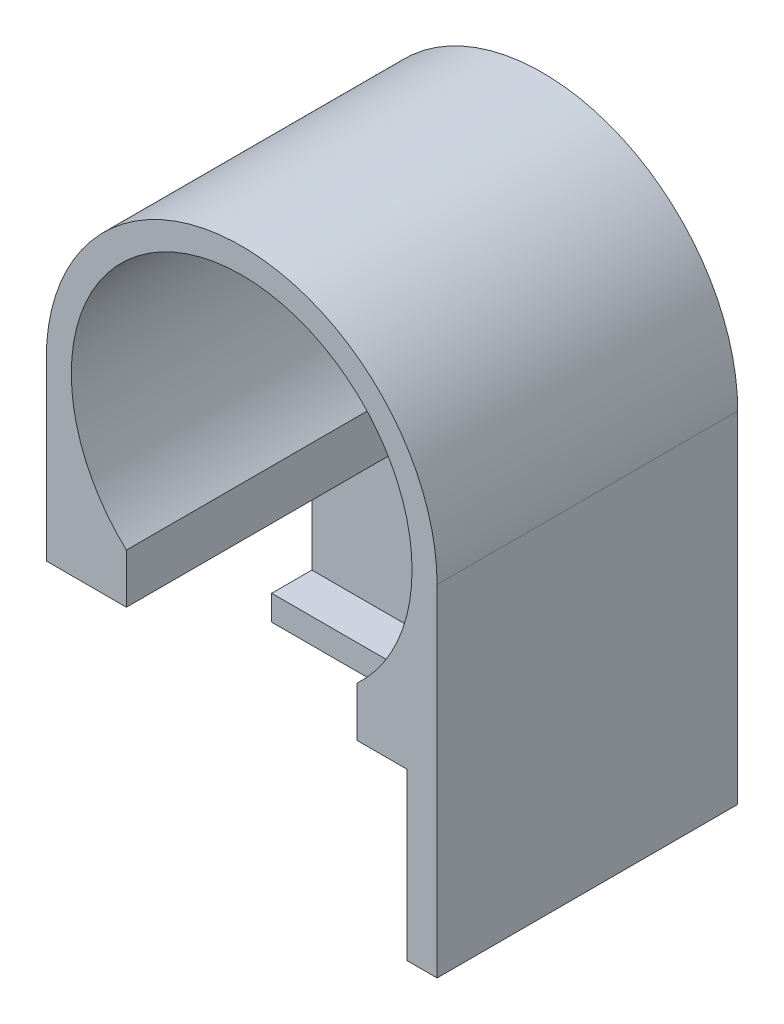
ISO-10303-21;
HEADER;
FILE_DESCRIPTION(('STEP AP214'),'2;1');
FILE_NAME('part.step','',(''),(''),'','','');
FILE_SCHEMA(('AUTOMOTIVE_DESIGN { 1 0 10303 214 1 1 1 1 }'));
ENDSEC;
DATA;
#1=APPLICATION_CONTEXT('core data for automotive mechanical design processes');
#2=APPLICATION_PROTOCOL_DEFINITION('international standard','automotive_design',2000,#1);
#3=PRODUCT_CONTEXT('',#1,'mechanical');
#4=PRODUCT('Part','Part','',(#3));
#5=PRODUCT_RELATED_PRODUCT_CATEGORY('part','',(#4));
#6=PRODUCT_DEFINITION_FORMATION('','',#4);
#7=PRODUCT_DEFINITION_CONTEXT('part definition',#1,'design');
#8=PRODUCT_DEFINITION('design','',#6,#7);
#9=PRODUCT_DEFINITION_SHAPE('','',#8);
#10=(LENGTH_UNIT() NAMED_UNIT(*) SI_UNIT(.MILLI.,.METRE.));
#11=(NAMED_UNIT(*) PLANE_ANGLE_UNIT() SI_UNIT($,.RADIAN.));
#12=(NAMED_UNIT(*) SI_UNIT($,.STERADIAN.) SOLID_ANGLE_UNIT());
#13=UNCERTAINTY_MEASURE_WITH_UNIT(LENGTH_MEASURE(1.E-05),#10,'distance_accuracy_value','');
#14=(GEOMETRIC_REPRESENTATION_CONTEXT(3) GLOBAL_UNCERTAINTY_ASSIGNED_CONTEXT((#13)) GLOBAL_UNIT_ASSIGNED_CONTEXT((#10,
#11,#12)) REPRESENTATION_CONTEXT('',''));
#15=CARTESIAN_POINT('',(0.,0.,0.));
#16=DIRECTION('',(0.,0.,1.));
#17=DIRECTION('',(1.,0.,0.));
#18=AXIS2_PLACEMENT_3D('',#15,#16,#17);
#19=CARTESIAN_POINT('',(0.,0.,76.2));
#20=DIRECTION('',(0.,0.,1.));
#21=DIRECTION('',(1.,0.,0.));
#22=AXIS2_PLACEMENT_3D('',#19,#20,#21);
#23=PLANE('',#22);
#24=DIRECTION('',(-1.,0.,0.));
#25=VECTOR('',#24,1.);
#26=CARTESIAN_POINT('',(41.91,-44.3563914856903,76.2));
#27=LINE('',#26,#25);
#28=CARTESIAN_POINT('',(-29.21,-44.3563914856903,76.2));
#29=VERTEX_POINT('',#28);
#30=CARTESIAN_POINT('',(-49.53,-44.3563914856903,76.2));
#31=VERTEX_POINT('',#30);
#32=EDGE_CURVE('E186',#29,#31,#27,.T.);
#33=ORIENTED_EDGE('',*,*,#32,.F.);
#34=DIRECTION('',(0.,1.,0.));
#35=VECTOR('',#34,1.);
#36=CARTESIAN_POINT('',(-29.21,-64.4223914856903,76.2));
#37=LINE('',#36,#35);
#38=CARTESIAN_POINT('',(-29.21,-31.8007594248943,76.2));
#39=VERTEX_POINT('',#38);
#40=EDGE_CURVE('E274',#29,#39,#37,.T.);
#41=ORIENTED_EDGE('',*,*,#40,.T.);
#42=CARTESIAN_POINT('',(0.,0.,76.2));
#43=DIRECTION('',(0.,0.,1.));
#44=DIRECTION('',(1.,0.,0.));
#45=AXIS2_PLACEMENT_3D('',#42,#43,#44);
#46=CIRCLE('',#45,43.18);
#47=CARTESIAN_POINT('',(29.21,-31.8007594248943,76.2));
#48=VERTEX_POINT('',#47);
#49=EDGE_CURVE('E223',#48,#39,#46,.T.);
#50=ORIENTED_EDGE('',*,*,#49,.F.);
#51=DIRECTION('',(0.,1.,0.));
#52=VECTOR('',#51,1.);
#53=CARTESIAN_POINT('',(29.21,-64.4223914856903,76.2));
#54=LINE('',#53,#52);
#55=CARTESIAN_POINT('',(29.21,-44.3563914856903,76.2));
#56=VERTEX_POINT('',#55);
#57=EDGE_CURVE('E132',#56,#48,#54,.T.);
#58=ORIENTED_EDGE('',*,*,#57,.F.);
#59=CARTESIAN_POINT('',(41.91,-44.3563914856903,76.2));
#60=VERTEX_POINT('',#59);
#61=EDGE_CURVE('E182',#60,#56,#27,.T.);
#62=ORIENTED_EDGE('',*,*,#61,.F.);
#63=DIRECTION('',(0.,1.,0.));
#64=VECTOR('',#63,1.);
#65=CARTESIAN_POINT('',(41.91,0.,76.2));
#66=LINE('',#65,#64);
#67=CARTESIAN_POINT('',(41.91,-86.36,76.2));
#68=VERTEX_POINT('',#67);
#69=EDGE_CURVE('E171',#68,#60,#66,.T.);
#70=ORIENTED_EDGE('',*,*,#69,.F.);
#71=DIRECTION('',(-1.,0.,0.));
#72=VECTOR('',#71,1.);
#73=CARTESIAN_POINT('',(0.,-86.36,76.2));
#74=LINE('',#73,#72);
#75=CARTESIAN_POINT('',(49.53,-86.36,76.2));
#76=VERTEX_POINT('',#75);
#77=EDGE_CURVE('E198',#76,#68,#74,.T.);
#78=ORIENTED_EDGE('',*,*,#77,.F.);
#79=DIRECTION('',(0.,-1.,0.));
#80=VECTOR('',#79,1.);
#81=CARTESIAN_POINT('',(49.53,0.,76.2));
#82=LINE('',#81,#80);
#83=CARTESIAN_POINT('',(49.53,0.,76.2));
#84=VERTEX_POINT('',#83);
#85=EDGE_CURVE('E202',#84,#76,#82,.T.);
#86=ORIENTED_EDGE('',*,*,#85,.F.);
#87=CARTESIAN_POINT('',(0.,0.,76.2));
#88=DIRECTION('',(0.,0.,1.));
#89=DIRECTION('',(1.,0.,0.));
#90=AXIS2_PLACEMENT_3D('',#87,#88,#89);
#91=CIRCLE('',#90,49.53);
#92=CARTESIAN_POINT('',(-49.53,0.,76.2));
#93=VERTEX_POINT('',#92);
#94=EDGE_CURVE('E11',#84,#93,#91,.T.);
#95=ORIENTED_EDGE('',*,*,#94,.T.);
#96=DIRECTION('',(0.,-1.,0.));
#97=VECTOR('',#96,1.);
#98=CARTESIAN_POINT('',(-49.53,0.,76.2));
#99=LINE('',#98,#97);
#100=EDGE_CURVE('E195',#93,#31,#99,.T.);
#101=ORIENTED_EDGE('',*,*,#100,.T.);
#102=EDGE_LOOP('',(#33,#41,#50,#58,#62,#70,#78,#86,#95,#101));
#103=FACE_BOUND('',#102,.T.);
#104=ADVANCED_FACE('F36',(#103),#23,.T.);
#105=CARTESIAN_POINT('',(0.,0.,76.2));
#106=DIRECTION('',(0.,0.,-1.));
#107=DIRECTION('',(-1.,0.,0.));
#108=AXIS2_PLACEMENT_3D('',#105,#106,#107);
#109=CYLINDRICAL_SURFACE('',#108,43.18);
#110=CARTESIAN_POINT('',(0.,0.,0.));
#111=DIRECTION('',(0.,0.,1.));
#112=DIRECTION('',(1.,0.,0.));
#113=AXIS2_PLACEMENT_3D('',#110,#111,#112);
#114=CIRCLE('',#113,43.18);
#115=CARTESIAN_POINT('',(43.18,0.,0.));
#116=VERTEX_POINT('',#115);
#117=EDGE_CURVE('E222',#116,#116,#114,.T.);
#118=ORIENTED_EDGE('',*,*,#117,.F.);
#119=EDGE_LOOP('',(#118));
#120=FACE_BOUND('',#119,.T.);
#121=ORIENTED_EDGE('',*,*,#49,.T.);
#122=DIRECTION('',(0.,0.,-1.));
#123=VECTOR('',#122,1.);
#124=CARTESIAN_POINT('',(-29.21,-31.8007594248942,76.2));
#125=LINE('',#124,#123);
#126=CARTESIAN_POINT('',(-29.21,-31.8007594248942,8.8798451922827));
#127=VERTEX_POINT('',#126);
#128=EDGE_CURVE('E152',#39,#127,#125,.T.);
#129=ORIENTED_EDGE('',*,*,#128,.T.);
#130=CARTESIAN_POINT('',(0.,0.,8.8798451922827));
#131=DIRECTION('',(0.,0.,1.));
#132=DIRECTION('',(1.,0.,0.));
#133=AXIS2_PLACEMENT_3D('',#130,#131,#132);
#134=CIRCLE('',#133,43.18);
#135=CARTESIAN_POINT('',(29.21,-31.8007594248943,8.87984519228268));
#136=VERTEX_POINT('',#135);
#137=EDGE_CURVE('E144',#127,#136,#134,.T.);
#138=ORIENTED_EDGE('',*,*,#137,.T.);
#139=DIRECTION('',(0.,0.,-1.));
#140=VECTOR('',#139,1.);
#141=CARTESIAN_POINT('',(29.21,-31.8007594248942,76.2));
#142=LINE('',#141,#140);
#143=EDGE_CURVE('E129',#48,#136,#142,.T.);
#144=ORIENTED_EDGE('',*,*,#143,.F.);
#145=EDGE_LOOP('',(#121,#129,#138,#144));
#146=FACE_BOUND('',#145,.T.);
#147=ADVANCED_FACE('F151',(#120,#146),#109,.F.);
#148=CARTESIAN_POINT('',(41.91,-44.3563914856903,0.));
#149=DIRECTION('',(0.,-1.,0.));
#150=DIRECTION('',(0.,0.,-1.));
#151=AXIS2_PLACEMENT_3D('',#148,#149,#150);
#152=PLANE('',#151);
#153=DIRECTION('',(-1.,0.,0.));
#154=VECTOR('',#153,1.);
#155=CARTESIAN_POINT('',(41.91,-44.3563914856903,8.87984519228268));
#156=LINE('',#155,#154);
#157=CARTESIAN_POINT('',(-29.21,-44.3563914856903,8.87984519228268));
#158=VERTEX_POINT('',#157);
#159=CARTESIAN_POINT('',(-49.53,-44.3563914856903,8.87984519228268));
#160=VERTEX_POINT('',#159);
#161=EDGE_CURVE('E173',#158,#160,#156,.T.);
#162=ORIENTED_EDGE('',*,*,#161,.F.);
#163=DIRECTION('',(0.,0.,1.));
#164=VECTOR('',#163,1.);
#165=CARTESIAN_POINT('',(-29.21,-44.3563914856903,0.));
#166=LINE('',#165,#164);
#167=EDGE_CURVE('E137',#158,#29,#166,.T.);
#168=ORIENTED_EDGE('',*,*,#167,.T.);
#169=ORIENTED_EDGE('',*,*,#32,.T.);
#170=DIRECTION('',(0.,0.,1.));
#171=VECTOR('',#170,1.);
#172=CARTESIAN_POINT('',(-49.53,-44.3563914856903,0.));
#173=LINE('',#172,#171);
#174=EDGE_CURVE('E153',#160,#31,#173,.T.);
#175=ORIENTED_EDGE('',*,*,#174,.F.);
#176=EDGE_LOOP('',(#162,#168,#169,#175));
#177=FACE_BOUND('',#176,.T.);
#178=ADVANCED_FACE('F231',(#177),#152,.T.);
#179=CARTESIAN_POINT('',(-49.53,0.,76.2));
#180=DIRECTION('',(1.,0.,0.));
#181=DIRECTION('',(0.,0.,-1.));
#182=AXIS2_PLACEMENT_3D('',#179,#180,#181);
#183=PLANE('',#182);
#184=ORIENTED_EDGE('',*,*,#174,.T.);
#185=ORIENTED_EDGE('',*,*,#100,.F.);
#186=DIRECTION('',(0.,0.,-1.));
#187=VECTOR('',#186,1.);
#188=CARTESIAN_POINT('',(-49.53,0.,76.2));
#189=LINE('',#188,#187);
#190=CARTESIAN_POINT('',(-49.53,0.,0.));
#191=VERTEX_POINT('',#190);
#192=EDGE_CURVE('E219',#93,#191,#189,.T.);
#193=ORIENTED_EDGE('',*,*,#192,.T.);
#194=DIRECTION('',(0.,-1.,0.));
#195=VECTOR('',#194,1.);
#196=CARTESIAN_POINT('',(-49.53,0.,0.));
#197=LINE('',#196,#195);
#198=CARTESIAN_POINT('',(-49.53,-86.36,0.));
#199=VERTEX_POINT('',#198);
#200=EDGE_CURVE('E185',#191,#199,#197,.T.);
#201=ORIENTED_EDGE('',*,*,#200,.T.);
#202=DIRECTION('',(0.,0.,-1.));
#203=VECTOR('',#202,1.);
#204=CARTESIAN_POINT('',(-49.53,-86.36,76.2));
#205=LINE('',#204,#203);
#206=CARTESIAN_POINT('',(-49.53,-86.36,19.0651346971329));
#207=VERTEX_POINT('',#206);
#208=EDGE_CURVE('E217',#207,#199,#205,.T.);
#209=ORIENTED_EDGE('',*,*,#208,.F.);
#210=DIRECTION('',(0.,1.,0.));
#211=VECTOR('',#210,1.);
#212=CARTESIAN_POINT('',(-49.53,0.,19.0651346971329));
#213=LINE('',#212,#211);
#214=CARTESIAN_POINT('',(-49.53,-80.01,19.0651346971329));
#215=VERTEX_POINT('',#214);
#216=EDGE_CURVE('E164',#207,#215,#213,.T.);
#217=ORIENTED_EDGE('',*,*,#216,.T.);
#218=DIRECTION('',(0.,0.,1.));
#219=VECTOR('',#218,1.);
#220=CARTESIAN_POINT('',(-49.53,-80.01,0.));
#221=LINE('',#220,#219);
#222=CARTESIAN_POINT('',(-49.53,-80.01,8.87984519228269));
#223=VERTEX_POINT('',#222);
#224=EDGE_CURVE('E177',#223,#215,#221,.T.);
#225=ORIENTED_EDGE('',*,*,#224,.F.);
#226=DIRECTION('',(0.,1.,0.));
#227=VECTOR('',#226,1.);
#228=CARTESIAN_POINT('',(-49.53,0.,8.87984519228268));
#229=LINE('',#228,#227);
#230=EDGE_CURVE('E156',#223,#160,#229,.T.);
#231=ORIENTED_EDGE('',*,*,#230,.T.);
#232=EDGE_LOOP('',(#184,#185,#193,#201,#209,#217,#225,#231));
#233=FACE_BOUND('',#232,.T.);
#234=ADVANCED_FACE('F237',(#233),#183,.F.);
#235=CARTESIAN_POINT('',(0.,-86.36,76.2));
#236=DIRECTION('',(0.,-1.,0.));
#237=DIRECTION('',(0.,0.,-1.));
#238=AXIS2_PLACEMENT_3D('',#235,#236,#237);
#239=PLANE('',#238);
#240=DIRECTION('',(0.,0.,1.));
#241=VECTOR('',#240,1.);
#242=CARTESIAN_POINT('',(41.91,-86.36,0.));
#243=LINE('',#242,#241);
#244=CARTESIAN_POINT('',(41.91,-86.36,19.0651346971329));
#245=VERTEX_POINT('',#244);
#246=EDGE_CURVE('E169',#245,#68,#243,.T.);
#247=ORIENTED_EDGE('',*,*,#246,.F.);
#248=DIRECTION('',(-1.,0.,0.));
#249=VECTOR('',#248,1.);
#250=CARTESIAN_POINT('',(41.91,-86.36,19.0651346971329));
#251=LINE('',#250,#249);
#252=EDGE_CURVE('E187',#245,#207,#251,.T.);
#253=ORIENTED_EDGE('',*,*,#252,.T.);
#254=ORIENTED_EDGE('',*,*,#208,.T.);
#255=DIRECTION('',(-1.,0.,0.));
#256=VECTOR('',#255,1.);
#257=CARTESIAN_POINT('',(0.,-86.36,0.));
#258=LINE('',#257,#256);
#259=CARTESIAN_POINT('',(49.53,-86.36,0.));
#260=VERTEX_POINT('',#259);
#261=EDGE_CURVE('E208',#260,#199,#258,.T.);
#262=ORIENTED_EDGE('',*,*,#261,.F.);
#263=DIRECTION('',(0.,0.,-1.));
#264=VECTOR('',#263,1.);
#265=CARTESIAN_POINT('',(49.53,-86.36,76.2));
#266=LINE('',#265,#264);
#267=EDGE_CURVE('E215',#76,#260,#266,.T.);
#268=ORIENTED_EDGE('',*,*,#267,.F.);
#269=ORIENTED_EDGE('',*,*,#77,.T.);
#270=EDGE_LOOP('',(#247,#253,#254,#262,#268,#269));
#271=FACE_BOUND('',#270,.T.);
#272=ADVANCED_FACE('F254',(#271),#239,.T.);
#273=CARTESIAN_POINT('',(0.,0.,76.2));
#274=DIRECTION('',(0.,0.,-1.));
#275=DIRECTION('',(-1.,0.,0.));
#276=AXIS2_PLACEMENT_3D('',#273,#274,#275);
#277=CYLINDRICAL_SURFACE('',#276,49.53);
#278=ORIENTED_EDGE('',*,*,#192,.F.);
#279=ORIENTED_EDGE('',*,*,#94,.F.);
#280=DIRECTION('',(0.,0.,-1.));
#281=VECTOR('',#280,1.);
#282=CARTESIAN_POINT('',(49.53,0.,76.2));
#283=LINE('',#282,#281);
#284=CARTESIAN_POINT('',(49.53,0.,0.));
#285=VERTEX_POINT('',#284);
#286=EDGE_CURVE('E205',#84,#285,#283,.T.);
#287=ORIENTED_EDGE('',*,*,#286,.T.);
#288=CARTESIAN_POINT('',(0.,0.,0.));
#289=DIRECTION('',(0.,0.,1.));
#290=DIRECTION('',(1.,0.,0.));
#291=AXIS2_PLACEMENT_3D('',#288,#289,#290);
#292=CIRCLE('',#291,49.53);
#293=EDGE_CURVE('E40',#285,#191,#292,.T.);
#294=ORIENTED_EDGE('',*,*,#293,.T.);
#295=EDGE_LOOP('',(#278,#279,#287,#294));
#296=FACE_BOUND('',#295,.T.);
#297=ADVANCED_FACE('F38',(#296),#277,.T.);
#298=CARTESIAN_POINT('',(0.,0.,0.));
#299=DIRECTION('',(0.,0.,1.));
#300=DIRECTION('',(1.,0.,0.));
#301=AXIS2_PLACEMENT_3D('',#298,#299,#300);
#302=PLANE('',#301);
#303=ORIENTED_EDGE('',*,*,#293,.F.);
#304=DIRECTION('',(0.,-1.,0.));
#305=VECTOR('',#304,1.);
#306=CARTESIAN_POINT('',(49.53,0.,0.));
#307=LINE('',#306,#305);
#308=EDGE_CURVE('E199',#285,#260,#307,.T.);
#309=ORIENTED_EDGE('',*,*,#308,.T.);
#310=ORIENTED_EDGE('',*,*,#261,.T.);
#311=ORIENTED_EDGE('',*,*,#200,.F.);
#312=EDGE_LOOP('',(#303,#309,#310,#311));
#313=FACE_BOUND('',#312,.T.);
#314=ORIENTED_EDGE('',*,*,#117,.T.);
#315=EDGE_LOOP('',(#314));
#316=FACE_BOUND('',#315,.T.);
#317=ADVANCED_FACE('F228',(#313,#316),#302,.F.);
#318=CARTESIAN_POINT('',(49.53,0.,76.2));
#319=DIRECTION('',(1.,0.,0.));
#320=DIRECTION('',(0.,0.,-1.));
#321=AXIS2_PLACEMENT_3D('',#318,#319,#320);
#322=PLANE('',#321);
#323=ORIENTED_EDGE('',*,*,#308,.F.);
#324=ORIENTED_EDGE('',*,*,#286,.F.);
#325=ORIENTED_EDGE('',*,*,#85,.T.);
#326=ORIENTED_EDGE('',*,*,#267,.T.);
#327=EDGE_LOOP('',(#323,#324,#325,#326));
#328=FACE_BOUND('',#327,.T.);
#329=ADVANCED_FACE('F246',(#328),#322,.T.);
#330=DIRECTION('',(0.,0.,1.));
#331=VECTOR('',#330,1.);
#332=CARTESIAN_POINT('',(29.21,-44.3563914856903,0.));
#333=LINE('',#332,#331);
#334=CARTESIAN_POINT('',(29.21,-44.3563914856903,8.87984519228268));
#335=VERTEX_POINT('',#334);
#336=EDGE_CURVE('E138',#335,#56,#333,.T.);
#337=ORIENTED_EDGE('',*,*,#336,.F.);
#338=CARTESIAN_POINT('',(41.91,-44.3563914856903,8.87984519228268));
#339=VERTEX_POINT('',#338);
#340=EDGE_CURVE('E147',#339,#335,#156,.T.);
#341=ORIENTED_EDGE('',*,*,#340,.F.);
#342=DIRECTION('',(0.,0.,1.));
#343=VECTOR('',#342,1.);
#344=CARTESIAN_POINT('',(41.91,-44.3563914856903,0.));
#345=LINE('',#344,#343);
#346=EDGE_CURVE('E161',#339,#60,#345,.T.);
#347=ORIENTED_EDGE('',*,*,#346,.T.);
#348=ORIENTED_EDGE('',*,*,#61,.T.);
#349=EDGE_LOOP('',(#337,#341,#347,#348));
#350=FACE_BOUND('',#349,.T.);
#351=ADVANCED_FACE('F240',(#350),#152,.T.);
#352=CARTESIAN_POINT('',(41.91,0.,19.0651346971329));
#353=DIRECTION('',(0.,0.,1.));
#354=DIRECTION('',(1.,0.,0.));
#355=AXIS2_PLACEMENT_3D('',#352,#353,#354);
#356=PLANE('',#355);
#357=ORIENTED_EDGE('',*,*,#216,.F.);
#358=ORIENTED_EDGE('',*,*,#252,.F.);
#359=DIRECTION('',(0.,1.,0.));
#360=VECTOR('',#359,1.);
#361=CARTESIAN_POINT('',(41.91,0.,19.0651346971329));
#362=LINE('',#361,#360);
#363=CARTESIAN_POINT('',(41.91,-80.01,19.0651346971329));
#364=VERTEX_POINT('',#363);
#365=EDGE_CURVE('E59',#245,#364,#362,.T.);
#366=ORIENTED_EDGE('',*,*,#365,.T.);
#367=DIRECTION('',(-1.,0.,0.));
#368=VECTOR('',#367,1.);
#369=CARTESIAN_POINT('',(41.91,-80.01,19.0651346971329));
#370=LINE('',#369,#368);
#371=EDGE_CURVE('E190',#364,#215,#370,.T.);
#372=ORIENTED_EDGE('',*,*,#371,.T.);
#373=EDGE_LOOP('',(#357,#358,#366,#372));
#374=FACE_BOUND('',#373,.T.);
#375=ADVANCED_FACE('F292',(#374),#356,.T.);
#376=CARTESIAN_POINT('',(41.91,-80.01,0.));
#377=DIRECTION('',(0.,-1.,0.));
#378=DIRECTION('',(0.,0.,-1.));
#379=AXIS2_PLACEMENT_3D('',#376,#377,#378);
#380=PLANE('',#379);
#381=ORIENTED_EDGE('',*,*,#224,.T.);
#382=ORIENTED_EDGE('',*,*,#371,.F.);
#383=DIRECTION('',(0.,0.,1.));
#384=VECTOR('',#383,1.);
#385=CARTESIAN_POINT('',(41.91,-80.01,0.));
#386=LINE('',#385,#384);
#387=CARTESIAN_POINT('',(41.91,-80.01,8.87984519228269));
#388=VERTEX_POINT('',#387);
#389=EDGE_CURVE('E166',#388,#364,#386,.T.);
#390=ORIENTED_EDGE('',*,*,#389,.F.);
#391=DIRECTION('',(-1.,0.,0.));
#392=VECTOR('',#391,1.);
#393=CARTESIAN_POINT('',(41.91,-80.01,8.87984519228269));
#394=LINE('',#393,#392);
#395=EDGE_CURVE('E192',#388,#223,#394,.T.);
#396=ORIENTED_EDGE('',*,*,#395,.T.);
#397=EDGE_LOOP('',(#381,#382,#390,#396));
#398=FACE_BOUND('',#397,.T.);
#399=ADVANCED_FACE('F289',(#398),#380,.F.);
#400=CARTESIAN_POINT('',(41.91,0.,8.87984519228268));
#401=DIRECTION('',(0.,0.,1.));
#402=DIRECTION('',(0.,-1.,0.));
#403=AXIS2_PLACEMENT_3D('',#400,#401,#402);
#404=PLANE('',#403);
#405=ORIENTED_EDGE('',*,*,#340,.T.);
#406=DIRECTION('',(0.,1.,0.));
#407=VECTOR('',#406,1.);
#408=CARTESIAN_POINT('',(29.21,-64.4223914856903,8.87984519228268));
#409=LINE('',#408,#407);
#410=EDGE_CURVE('E51',#335,#136,#409,.T.);
#411=ORIENTED_EDGE('',*,*,#410,.T.);
#412=ORIENTED_EDGE('',*,*,#137,.F.);
#413=DIRECTION('',(0.,1.,0.));
#414=VECTOR('',#413,1.);
#415=CARTESIAN_POINT('',(-29.21,-64.4223914856903,8.87984519228268));
#416=LINE('',#415,#414);
#417=EDGE_CURVE('E148',#158,#127,#416,.T.);
#418=ORIENTED_EDGE('',*,*,#417,.F.);
#419=ORIENTED_EDGE('',*,*,#161,.T.);
#420=ORIENTED_EDGE('',*,*,#230,.F.);
#421=ORIENTED_EDGE('',*,*,#395,.F.);
#422=DIRECTION('',(0.,1.,0.));
#423=VECTOR('',#422,1.);
#424=CARTESIAN_POINT('',(41.91,0.,8.87984519228268));
#425=LINE('',#424,#423);
#426=EDGE_CURVE('E163',#388,#339,#425,.T.);
#427=ORIENTED_EDGE('',*,*,#426,.T.);
#428=EDGE_LOOP('',(#405,#411,#412,#418,#419,#420,#421,#427));
#429=FACE_BOUND('',#428,.T.);
#430=ADVANCED_FACE('F142',(#429),#404,.T.);
#431=CARTESIAN_POINT('',(41.91,0.,0.));
#432=DIRECTION('',(-1.,0.,0.));
#433=DIRECTION('',(0.,0.,1.));
#434=AXIS2_PLACEMENT_3D('',#431,#432,#433);
#435=PLANE('',#434);
#436=ORIENTED_EDGE('',*,*,#346,.F.);
#437=ORIENTED_EDGE('',*,*,#426,.F.);
#438=ORIENTED_EDGE('',*,*,#389,.T.);
#439=ORIENTED_EDGE('',*,*,#365,.F.);
#440=ORIENTED_EDGE('',*,*,#246,.T.);
#441=ORIENTED_EDGE('',*,*,#69,.T.);
#442=EDGE_LOOP('',(#436,#437,#438,#439,#440,#441));
#443=FACE_BOUND('',#442,.T.);
#444=ADVANCED_FACE('F271',(#443),#435,.T.);
#445=CARTESIAN_POINT('',(-29.21,-64.4223914856903,0.));
#446=DIRECTION('',(1.,0.,0.));
#447=DIRECTION('',(0.,0.,-1.));
#448=AXIS2_PLACEMENT_3D('',#445,#446,#447);
#449=PLANE('',#448);
#450=ORIENTED_EDGE('',*,*,#40,.F.);
#451=ORIENTED_EDGE('',*,*,#167,.F.);
#452=ORIENTED_EDGE('',*,*,#417,.T.);
#453=ORIENTED_EDGE('',*,*,#128,.F.);
#454=EDGE_LOOP('',(#450,#451,#452,#453));
#455=FACE_BOUND('',#454,.T.);
#456=ADVANCED_FACE('F283',(#455),#449,.T.);
#457=CARTESIAN_POINT('',(29.21,-64.4223914856903,0.));
#458=DIRECTION('',(1.,0.,0.));
#459=DIRECTION('',(0.,0.,-1.));
#460=AXIS2_PLACEMENT_3D('',#457,#458,#459);
#461=PLANE('',#460);
#462=ORIENTED_EDGE('',*,*,#143,.T.);
#463=ORIENTED_EDGE('',*,*,#410,.F.);
#464=ORIENTED_EDGE('',*,*,#336,.T.);
#465=ORIENTED_EDGE('',*,*,#57,.T.);
#466=EDGE_LOOP('',(#462,#463,#464,#465));
#467=FACE_BOUND('',#466,.T.);
#468=ADVANCED_FACE('F130',(#467),#461,.F.);
#469=CLOSED_SHELL('',(#104,#147,#178,#234,#272,#297,#317,#329,#351,#375,#399,#430,#444,#456,#468));
#470=MANIFOLD_SOLID_BREP('B2',#469);
#471=ADVANCED_BREP_SHAPE_REPRESENTATION('',(#18,#470),#14);
#472=SHAPE_DEFINITION_REPRESENTATION(#9,#471);
ENDSEC;
END-ISO-10303-21;
